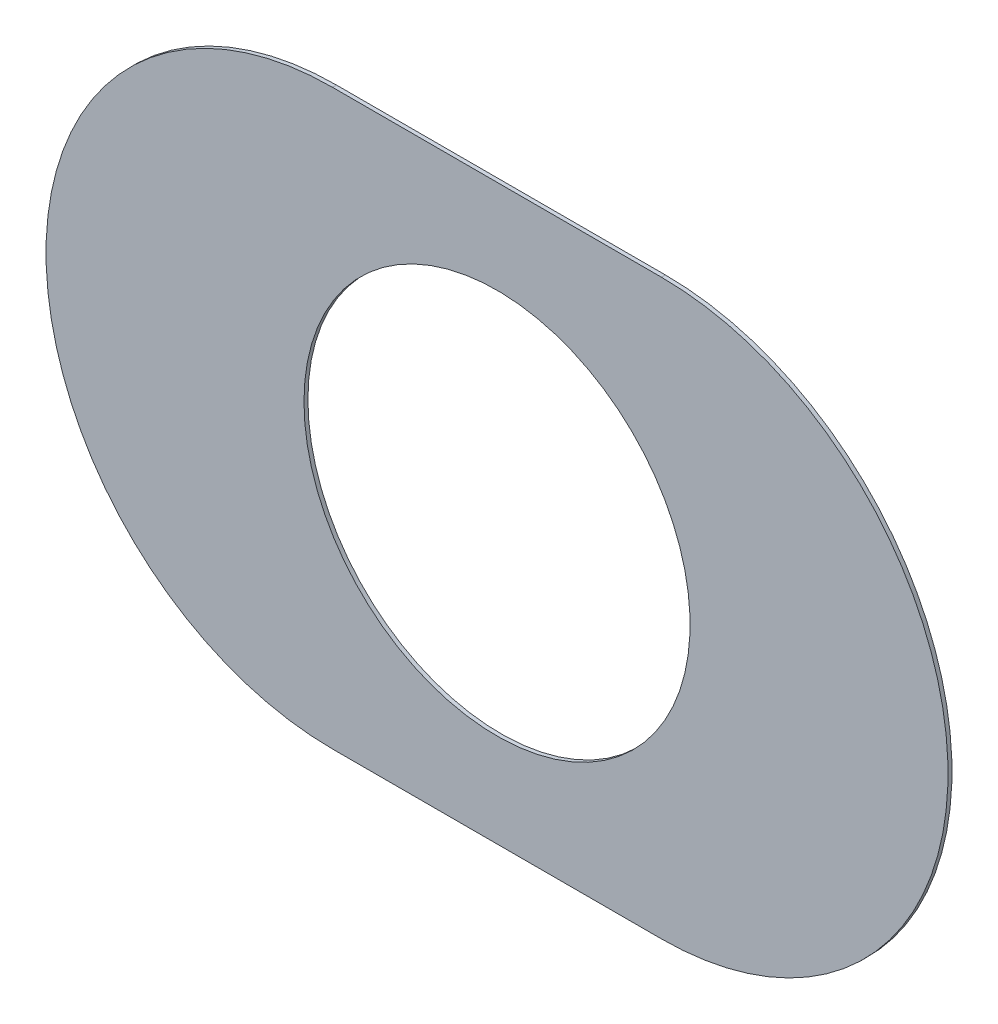
ISO-10303-21;
HEADER;
FILE_DESCRIPTION(('STEP AP214'),'2;1');
FILE_NAME('part.step','',(''),(''),'','','');
FILE_SCHEMA(('AUTOMOTIVE_DESIGN { 1 0 10303 214 1 1 1 1 }'));
ENDSEC;
DATA;
#1=APPLICATION_CONTEXT('core data for automotive mechanical design processes');
#2=APPLICATION_PROTOCOL_DEFINITION('international standard','automotive_design',2000,#1);
#3=PRODUCT_CONTEXT('',#1,'mechanical');
#4=PRODUCT('Part','Part','',(#3));
#5=PRODUCT_RELATED_PRODUCT_CATEGORY('part','',(#4));
#6=PRODUCT_DEFINITION_FORMATION('','',#4);
#7=PRODUCT_DEFINITION_CONTEXT('part definition',#1,'design');
#8=PRODUCT_DEFINITION('design','',#6,#7);
#9=PRODUCT_DEFINITION_SHAPE('','',#8);
#10=(LENGTH_UNIT() NAMED_UNIT(*) SI_UNIT(.MILLI.,.METRE.));
#11=(NAMED_UNIT(*) PLANE_ANGLE_UNIT() SI_UNIT($,.RADIAN.));
#12=(NAMED_UNIT(*) SI_UNIT($,.STERADIAN.) SOLID_ANGLE_UNIT());
#13=UNCERTAINTY_MEASURE_WITH_UNIT(LENGTH_MEASURE(1.E-05),#10,'distance_accuracy_value','');
#14=(GEOMETRIC_REPRESENTATION_CONTEXT(3) GLOBAL_UNCERTAINTY_ASSIGNED_CONTEXT((#13)) GLOBAL_UNIT_ASSIGNED_CONTEXT((#10,
#11,#12)) REPRESENTATION_CONTEXT('',''));
#15=CARTESIAN_POINT('',(0.,0.,0.));
#16=DIRECTION('',(0.,0.,1.));
#17=DIRECTION('',(1.,0.,0.));
#18=AXIS2_PLACEMENT_3D('',#15,#16,#17);
#19=CARTESIAN_POINT('',(1.54999965727325,14.5400006854535,0.));
#20=DIRECTION('',(0.,0.,-1.));
#21=DIRECTION('',(0.,-1.,0.));
#22=AXIS2_PLACEMENT_3D('',#19,#20,#21);
#23=PLANE('',#22);
#24=CARTESIAN_POINT('',(1.54999965727325,14.5400006854535,0.));
#25=DIRECTION('',(0.,0.,1.));
#26=DIRECTION('',(1.,0.,0.));
#27=AXIS2_PLACEMENT_3D('',#24,#25,#26);
#28=CIRCLE('',#27,0.49);
#29=CARTESIAN_POINT('',(1.05999965727325,14.5400006854535,0.));
#30=VERTEX_POINT('',#29);
#31=EDGE_CURVE('E85',#30,#30,#28,.T.);
#32=ORIENTED_EDGE('',*,*,#31,.F.);
#33=EDGE_LOOP('',(#32));
#34=FACE_BOUND('',#33,.T.);
#35=CARTESIAN_POINT('',(1.96740611181985,14.5400006854535,0.));
#36=DIRECTION('',(0.,0.,-1.));
#37=DIRECTION('',(0.,1.,0.));
#38=AXIS2_PLACEMENT_3D('',#35,#36,#37);
#39=CIRCLE('',#38,0.727257121659981);
#40=CARTESIAN_POINT('',(1.96740611181985,15.2672578071135,0.));
#41=VERTEX_POINT('',#40);
#42=CARTESIAN_POINT('',(1.96740611181985,13.8127435637935,0.));
#43=VERTEX_POINT('',#42);
#44=EDGE_CURVE('E28',#41,#43,#39,.T.);
#45=ORIENTED_EDGE('',*,*,#44,.F.);
#46=DIRECTION('',(1.,0.,0.));
#47=VECTOR('',#46,1.);
#48=CARTESIAN_POINT('',(1.13259320272665,15.2672578071135,0.));
#49=LINE('',#48,#47);
#50=CARTESIAN_POINT('',(1.13259320272665,15.2672578071135,0.));
#51=VERTEX_POINT('',#50);
#52=EDGE_CURVE('E21',#51,#41,#49,.T.);
#53=ORIENTED_EDGE('',*,*,#52,.F.);
#54=CARTESIAN_POINT('',(1.13259320272665,14.5400006854535,0.));
#55=DIRECTION('',(0.,0.,-1.));
#56=DIRECTION('',(0.,-1.,0.));
#57=AXIS2_PLACEMENT_3D('',#54,#55,#56);
#58=CIRCLE('',#57,0.727257121659981);
#59=CARTESIAN_POINT('',(1.13259320272665,13.8127435637935,0.));
#60=VERTEX_POINT('',#59);
#61=EDGE_CURVE('E113',#60,#51,#58,.T.);
#62=ORIENTED_EDGE('',*,*,#61,.F.);
#63=DIRECTION('',(-1.,0.,0.));
#64=VECTOR('',#63,1.);
#65=CARTESIAN_POINT('',(1.96740611181985,13.8127435637935,0.));
#66=LINE('',#65,#64);
#67=EDGE_CURVE('E107',#43,#60,#66,.T.);
#68=ORIENTED_EDGE('',*,*,#67,.F.);
#69=EDGE_LOOP('',(#45,#53,#62,#68));
#70=FACE_BOUND('',#69,.T.);
#71=ADVANCED_FACE('F17',(#34,#70),#23,.F.);
#72=CARTESIAN_POINT('',(1.54999965727325,14.5400006854535,-0.01));
#73=DIRECTION('',(0.,0.,-1.));
#74=DIRECTION('',(0.,-1.,0.));
#75=AXIS2_PLACEMENT_3D('',#72,#73,#74);
#76=PLANE('',#75);
#77=CARTESIAN_POINT('',(1.54999965727325,14.5400006854535,-0.01));
#78=DIRECTION('',(0.,0.,1.));
#79=DIRECTION('',(1.,0.,0.));
#80=AXIS2_PLACEMENT_3D('',#77,#78,#79);
#81=CIRCLE('',#80,0.49);
#82=CARTESIAN_POINT('',(1.05999965727325,14.5400006854535,-0.01));
#83=VERTEX_POINT('',#82);
#84=EDGE_CURVE('E96',#83,#83,#81,.T.);
#85=ORIENTED_EDGE('',*,*,#84,.T.);
#86=EDGE_LOOP('',(#85));
#87=FACE_BOUND('',#86,.T.);
#88=CARTESIAN_POINT('',(1.96740611181985,14.5400006854535,-0.01));
#89=DIRECTION('',(0.,0.,-1.));
#90=DIRECTION('',(0.,1.,0.));
#91=AXIS2_PLACEMENT_3D('',#88,#89,#90);
#92=CIRCLE('',#91,0.727257121659981);
#93=CARTESIAN_POINT('',(1.96740611181985,15.2672578071135,-0.01));
#94=VERTEX_POINT('',#93);
#95=CARTESIAN_POINT('',(1.96740611181985,13.8127435637935,-0.01));
#96=VERTEX_POINT('',#95);
#97=EDGE_CURVE('E11',#94,#96,#92,.T.);
#98=ORIENTED_EDGE('',*,*,#97,.T.);
#99=DIRECTION('',(-1.,0.,0.));
#100=VECTOR('',#99,1.);
#101=CARTESIAN_POINT('',(1.96740611181985,13.8127435637935,-0.01));
#102=LINE('',#101,#100);
#103=CARTESIAN_POINT('',(1.13259320272665,13.8127435637935,-0.01));
#104=VERTEX_POINT('',#103);
#105=EDGE_CURVE('E102',#96,#104,#102,.T.);
#106=ORIENTED_EDGE('',*,*,#105,.T.);
#107=CARTESIAN_POINT('',(1.13259320272665,14.5400006854535,-0.01));
#108=DIRECTION('',(0.,0.,-1.));
#109=DIRECTION('',(0.,-1.,0.));
#110=AXIS2_PLACEMENT_3D('',#107,#108,#109);
#111=CIRCLE('',#110,0.727257121659981);
#112=CARTESIAN_POINT('',(1.13259320272665,15.2672578071135,-0.01));
#113=VERTEX_POINT('',#112);
#114=EDGE_CURVE('E108',#104,#113,#111,.T.);
#115=ORIENTED_EDGE('',*,*,#114,.T.);
#116=DIRECTION('',(1.,0.,0.));
#117=VECTOR('',#116,1.);
#118=CARTESIAN_POINT('',(1.13259320272665,15.2672578071135,-0.01));
#119=LINE('',#118,#117);
#120=EDGE_CURVE('E114',#113,#94,#119,.T.);
#121=ORIENTED_EDGE('',*,*,#120,.T.);
#122=EDGE_LOOP('',(#98,#106,#115,#121));
#123=FACE_BOUND('',#122,.T.);
#124=ADVANCED_FACE('F131',(#87,#123),#76,.T.);
#125=CARTESIAN_POINT('',(1.96740611181985,14.5400006854535,0.));
#126=DIRECTION('',(0.,0.,-1.));
#127=DIRECTION('',(0.,1.,0.));
#128=AXIS2_PLACEMENT_3D('',#125,#126,#127);
#129=CYLINDRICAL_SURFACE('',#128,0.727257121659981);
#130=ORIENTED_EDGE('',*,*,#44,.T.);
#131=DIRECTION('',(0.,0.,-1.));
#132=VECTOR('',#131,1.);
#133=CARTESIAN_POINT('',(1.96740611181985,13.8127435637935,0.));
#134=LINE('',#133,#132);
#135=EDGE_CURVE('E100',#43,#96,#134,.T.);
#136=ORIENTED_EDGE('',*,*,#135,.T.);
#137=ORIENTED_EDGE('',*,*,#97,.F.);
#138=DIRECTION('',(0.,0.,-1.));
#139=VECTOR('',#138,1.);
#140=CARTESIAN_POINT('',(1.96740611181985,15.2672578071135,0.));
#141=LINE('',#140,#139);
#142=EDGE_CURVE('E95',#41,#94,#141,.T.);
#143=ORIENTED_EDGE('',*,*,#142,.F.);
#144=EDGE_LOOP('',(#130,#136,#137,#143));
#145=FACE_BOUND('',#144,.T.);
#146=ADVANCED_FACE('F136',(#145),#129,.T.);
#147=CARTESIAN_POINT('',(1.96740611181985,13.8127435637935,0.));
#148=DIRECTION('',(0.,-1.,0.));
#149=DIRECTION('',(0.,0.,-1.));
#150=AXIS2_PLACEMENT_3D('',#147,#148,#149);
#151=PLANE('',#150);
#152=ORIENTED_EDGE('',*,*,#67,.T.);
#153=DIRECTION('',(0.,0.,-1.));
#154=VECTOR('',#153,1.);
#155=CARTESIAN_POINT('',(1.13259320272665,13.8127435637935,0.));
#156=LINE('',#155,#154);
#157=EDGE_CURVE('E103',#60,#104,#156,.T.);
#158=ORIENTED_EDGE('',*,*,#157,.T.);
#159=ORIENTED_EDGE('',*,*,#105,.F.);
#160=ORIENTED_EDGE('',*,*,#135,.F.);
#161=EDGE_LOOP('',(#152,#158,#159,#160));
#162=FACE_BOUND('',#161,.T.);
#163=ADVANCED_FACE('F141',(#162),#151,.T.);
#164=CARTESIAN_POINT('',(1.13259320272665,14.5400006854535,0.));
#165=DIRECTION('',(0.,0.,-1.));
#166=DIRECTION('',(0.,-1.,0.));
#167=AXIS2_PLACEMENT_3D('',#164,#165,#166);
#168=CYLINDRICAL_SURFACE('',#167,0.727257121659981);
#169=ORIENTED_EDGE('',*,*,#61,.T.);
#170=DIRECTION('',(0.,0.,-1.));
#171=VECTOR('',#170,1.);
#172=CARTESIAN_POINT('',(1.13259320272665,15.2672578071135,0.));
#173=LINE('',#172,#171);
#174=EDGE_CURVE('E109',#51,#113,#173,.T.);
#175=ORIENTED_EDGE('',*,*,#174,.T.);
#176=ORIENTED_EDGE('',*,*,#114,.F.);
#177=ORIENTED_EDGE('',*,*,#157,.F.);
#178=EDGE_LOOP('',(#169,#175,#176,#177));
#179=FACE_BOUND('',#178,.T.);
#180=ADVANCED_FACE('F19',(#179),#168,.T.);
#181=CARTESIAN_POINT('',(1.13259320272665,15.2672578071135,0.));
#182=DIRECTION('',(0.,1.,0.));
#183=DIRECTION('',(1.,0.,0.));
#184=AXIS2_PLACEMENT_3D('',#181,#182,#183);
#185=PLANE('',#184);
#186=ORIENTED_EDGE('',*,*,#52,.T.);
#187=ORIENTED_EDGE('',*,*,#142,.T.);
#188=ORIENTED_EDGE('',*,*,#120,.F.);
#189=ORIENTED_EDGE('',*,*,#174,.F.);
#190=EDGE_LOOP('',(#186,#187,#188,#189));
#191=FACE_BOUND('',#190,.T.);
#192=ADVANCED_FACE('F135',(#191),#185,.T.);
#193=CARTESIAN_POINT('',(1.54999965727325,14.5400006854535,0.));
#194=DIRECTION('',(0.,0.,-1.));
#195=DIRECTION('',(1.,0.,0.));
#196=AXIS2_PLACEMENT_3D('',#193,#194,#195);
#197=CYLINDRICAL_SURFACE('',#196,0.49);
#198=ORIENTED_EDGE('',*,*,#84,.F.);
#199=DIRECTION('',(0.,0.,1.));
#200=VECTOR('',#199,1.);
#201=CARTESIAN_POINT('',(1.05999965727325,14.5400006854535,0.));
#202=LINE('',#201,#200);
#203=EDGE_CURVE('E79',#83,#30,#202,.T.);
#204=ORIENTED_EDGE('',*,*,#203,.T.);
#205=ORIENTED_EDGE('',*,*,#31,.T.);
#206=ORIENTED_EDGE('',*,*,#203,.F.);
#207=EDGE_LOOP('',(#198,#204,#205,#206));
#208=FACE_BOUND('',#207,.T.);
#209=ADVANCED_FACE('F86',(#208),#197,.F.);
#210=CLOSED_SHELL('',(#71,#124,#146,#163,#180,#192,#209));
#211=MANIFOLD_SOLID_BREP('B1',#210);
#212=ADVANCED_BREP_SHAPE_REPRESENTATION('',(#18,#211),#14);
#213=SHAPE_DEFINITION_REPRESENTATION(#9,#212);
ENDSEC;
END-ISO-10303-21;
